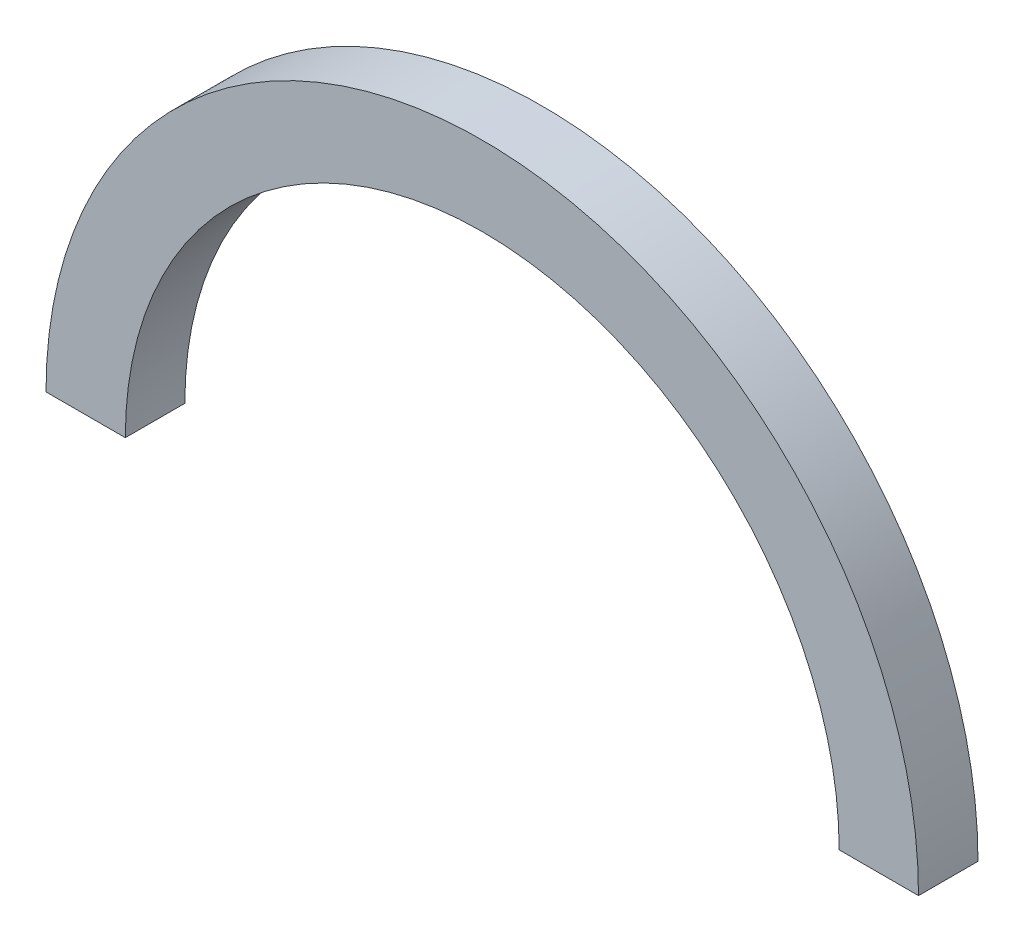
ISO-10303-21;
HEADER;
FILE_DESCRIPTION(('STEP AP214'),'2;1');
FILE_NAME('part.step','',(''),(''),'','','');
FILE_SCHEMA(('AUTOMOTIVE_DESIGN { 1 0 10303 214 1 1 1 1 }'));
ENDSEC;
DATA;
#1=APPLICATION_CONTEXT('core data for automotive mechanical design processes');
#2=APPLICATION_PROTOCOL_DEFINITION('international standard','automotive_design',2000,#1);
#3=PRODUCT_CONTEXT('',#1,'mechanical');
#4=PRODUCT('Part','Part','',(#3));
#5=PRODUCT_RELATED_PRODUCT_CATEGORY('part','',(#4));
#6=PRODUCT_DEFINITION_FORMATION('','',#4);
#7=PRODUCT_DEFINITION_CONTEXT('part definition',#1,'design');
#8=PRODUCT_DEFINITION('design','',#6,#7);
#9=PRODUCT_DEFINITION_SHAPE('','',#8);
#10=(LENGTH_UNIT() NAMED_UNIT(*) SI_UNIT(.MILLI.,.METRE.));
#11=(NAMED_UNIT(*) PLANE_ANGLE_UNIT() SI_UNIT($,.RADIAN.));
#12=(NAMED_UNIT(*) SI_UNIT($,.STERADIAN.) SOLID_ANGLE_UNIT());
#13=UNCERTAINTY_MEASURE_WITH_UNIT(LENGTH_MEASURE(1.E-05),#10,'distance_accuracy_value','');
#14=(GEOMETRIC_REPRESENTATION_CONTEXT(3) GLOBAL_UNCERTAINTY_ASSIGNED_CONTEXT((#13)) GLOBAL_UNIT_ASSIGNED_CONTEXT((#10,
#11,#12)) REPRESENTATION_CONTEXT('',''));
#15=CARTESIAN_POINT('',(0.,0.,0.));
#16=DIRECTION('',(0.,0.,1.));
#17=DIRECTION('',(1.,0.,0.));
#18=AXIS2_PLACEMENT_3D('',#15,#16,#17);
#19=CARTESIAN_POINT('',(0.,0.,0.));
#20=DIRECTION('',(0.,1.,0.));
#21=DIRECTION('',(0.,0.,1.));
#22=AXIS2_PLACEMENT_3D('',#19,#20,#21);
#23=PLANE('',#22);
#24=DIRECTION('',(0.,0.,-1.));
#25=VECTOR('',#24,1.);
#26=CARTESIAN_POINT('',(2595.77195150848,0.,-6775.62174536809));
#27=LINE('',#26,#25);
#28=CARTESIAN_POINT('',(2595.77195150848,0.,-6625.62174536809));
#29=VERTEX_POINT('',#28);
#30=CARTESIAN_POINT('',(2595.77195150848,0.,-6775.62174536809));
#31=VERTEX_POINT('',#30);
#32=EDGE_CURVE('E67',#29,#31,#27,.T.);
#33=ORIENTED_EDGE('',*,*,#32,.F.);
#34=DIRECTION('',(1.,0.,0.));
#35=VECTOR('',#34,1.);
#36=CARTESIAN_POINT('',(2395.77195150848,0.,-6625.62174536809));
#37=LINE('',#36,#35);
#38=CARTESIAN_POINT('',(2395.77195150848,0.,-6625.62174536809));
#39=VERTEX_POINT('',#38);
#40=EDGE_CURVE('E71',#39,#29,#37,.T.);
#41=ORIENTED_EDGE('',*,*,#40,.F.);
#42=DIRECTION('',(0.,0.,1.));
#43=VECTOR('',#42,1.);
#44=CARTESIAN_POINT('',(2395.77195150848,0.,-6775.62174536809));
#45=LINE('',#44,#43);
#46=CARTESIAN_POINT('',(2395.77195150848,0.,-6775.62174536809));
#47=VERTEX_POINT('',#46);
#48=EDGE_CURVE('E74',#47,#39,#45,.T.);
#49=ORIENTED_EDGE('',*,*,#48,.F.);
#50=DIRECTION('',(-1.,0.,0.));
#51=VECTOR('',#50,1.);
#52=CARTESIAN_POINT('',(2395.77195150848,0.,-6775.62174536809));
#53=LINE('',#52,#51);
#54=EDGE_CURVE('E62',#31,#47,#53,.T.);
#55=ORIENTED_EDGE('',*,*,#54,.F.);
#56=EDGE_LOOP('',(#33,#41,#49,#55));
#57=FACE_BOUND('',#56,.T.);
#58=ADVANCED_FACE('F32',(#57),#23,.F.);
#59=CARTESIAN_POINT('',(6991.54390301696,4.37633554764194E-13,0.));
#60=DIRECTION('',(0.,-1.,0.));
#61=DIRECTION('',(0.,0.,1.));
#62=AXIS2_PLACEMENT_3D('',#59,#60,#61);
#63=PLANE('',#62);
#64=DIRECTION('',(0.,0.,-1.));
#65=VECTOR('',#64,1.);
#66=CARTESIAN_POINT('',(4395.77195150848,1.1974317359106E-13,-6775.62174536809));
#67=LINE('',#66,#65);
#68=CARTESIAN_POINT('',(4395.77195150848,1.1974317359106E-13,-6625.62174536809));
#69=VERTEX_POINT('',#68);
#70=CARTESIAN_POINT('',(4395.77195150848,1.1974317359106E-13,-6775.62174536809));
#71=VERTEX_POINT('',#70);
#72=EDGE_CURVE('E45',#69,#71,#67,.T.);
#73=ORIENTED_EDGE('',*,*,#72,.T.);
#74=DIRECTION('',(1.,0.,0.));
#75=VECTOR('',#74,1.);
#76=CARTESIAN_POINT('',(4595.77195150848,1.44236109574007E-13,-6775.62174536809));
#77=LINE('',#76,#75);
#78=CARTESIAN_POINT('',(4595.77195150848,1.44236109574007E-13,-6775.62174536809));
#79=VERTEX_POINT('',#78);
#80=EDGE_CURVE('E11',#71,#79,#77,.T.);
#81=ORIENTED_EDGE('',*,*,#80,.T.);
#82=DIRECTION('',(0.,0.,1.));
#83=VECTOR('',#82,1.);
#84=CARTESIAN_POINT('',(4595.77195150848,1.44236109574007E-13,-6775.62174536809));
#85=LINE('',#84,#83);
#86=CARTESIAN_POINT('',(4595.77195150848,1.44236109574007E-13,-6625.62174536809));
#87=VERTEX_POINT('',#86);
#88=EDGE_CURVE('E88',#79,#87,#85,.T.);
#89=ORIENTED_EDGE('',*,*,#88,.T.);
#90=DIRECTION('',(-1.,0.,0.));
#91=VECTOR('',#90,1.);
#92=CARTESIAN_POINT('',(4595.77195150848,1.44236109574007E-13,-6625.62174536809));
#93=LINE('',#92,#91);
#94=EDGE_CURVE('E51',#87,#69,#93,.T.);
#95=ORIENTED_EDGE('',*,*,#94,.T.);
#96=EDGE_LOOP('',(#73,#81,#89,#95));
#97=FACE_BOUND('',#96,.T.);
#98=ADVANCED_FACE('F113',(#97),#63,.T.);
#99=CARTESIAN_POINT('',(3495.77195150848,0.,-6700.62174536809));
#100=DIRECTION('',(0.,0.,-1.));
#101=DIRECTION('',(-1.,0.,0.));
#102=AXIS2_PLACEMENT_3D('',#99,#100,#101);
#103=CYLINDRICAL_SURFACE('',#102,1100.);
#104=CARTESIAN_POINT('',(3495.77195150848,0.,-6625.62174536809));
#105=DIRECTION('',(0.,0.,-1.));
#106=DIRECTION('',(-1.,0.,0.));
#107=AXIS2_PLACEMENT_3D('',#104,#105,#106);
#108=CIRCLE('',#107,1100.);
#109=EDGE_CURVE('E90',#39,#87,#108,.T.);
#110=ORIENTED_EDGE('',*,*,#109,.T.);
#111=ORIENTED_EDGE('',*,*,#88,.F.);
#112=CARTESIAN_POINT('',(3495.77195150848,0.,-6775.62174536809));
#113=DIRECTION('',(0.,0.,-1.));
#114=DIRECTION('',(-1.,0.,0.));
#115=AXIS2_PLACEMENT_3D('',#112,#113,#114);
#116=CIRCLE('',#115,1100.);
#117=EDGE_CURVE('E84',#47,#79,#116,.T.);
#118=ORIENTED_EDGE('',*,*,#117,.F.);
#119=ORIENTED_EDGE('',*,*,#48,.T.);
#120=EDGE_LOOP('',(#110,#111,#118,#119));
#121=FACE_BOUND('',#120,.T.);
#122=ADVANCED_FACE('F87',(#121),#103,.T.);
#123=CARTESIAN_POINT('',(2395.77195150848,0.,-6625.62174536809));
#124=DIRECTION('',(0.,0.,1.));
#125=DIRECTION('',(1.,0.,0.));
#126=AXIS2_PLACEMENT_3D('',#123,#124,#125);
#127=PLANE('',#126);
#128=CARTESIAN_POINT('',(3495.77195150848,0.,-6625.62174536809));
#129=DIRECTION('',(0.,0.,-1.));
#130=DIRECTION('',(-1.,0.,0.));
#131=AXIS2_PLACEMENT_3D('',#128,#129,#130);
#132=CIRCLE('',#131,899.999999999999);
#133=EDGE_CURVE('E96',#29,#69,#132,.T.);
#134=ORIENTED_EDGE('',*,*,#133,.T.);
#135=ORIENTED_EDGE('',*,*,#94,.F.);
#136=ORIENTED_EDGE('',*,*,#109,.F.);
#137=ORIENTED_EDGE('',*,*,#40,.T.);
#138=EDGE_LOOP('',(#134,#135,#136,#137));
#139=FACE_BOUND('',#138,.T.);
#140=ADVANCED_FACE('F105',(#139),#127,.T.);
#141=CARTESIAN_POINT('',(3495.77195150848,0.,-6700.62174536809));
#142=DIRECTION('',(0.,0.,-1.));
#143=DIRECTION('',(-1.,0.,0.));
#144=AXIS2_PLACEMENT_3D('',#141,#142,#143);
#145=CYLINDRICAL_SURFACE('',#144,899.999999999999);
#146=CARTESIAN_POINT('',(3495.77195150848,0.,-6775.62174536809));
#147=DIRECTION('',(0.,0.,-1.));
#148=DIRECTION('',(-1.,0.,0.));
#149=AXIS2_PLACEMENT_3D('',#146,#147,#148);
#150=CIRCLE('',#149,899.999999999999);
#151=EDGE_CURVE('E39',#31,#71,#150,.T.);
#152=ORIENTED_EDGE('',*,*,#151,.T.);
#153=ORIENTED_EDGE('',*,*,#72,.F.);
#154=ORIENTED_EDGE('',*,*,#133,.F.);
#155=ORIENTED_EDGE('',*,*,#32,.T.);
#156=EDGE_LOOP('',(#152,#153,#154,#155));
#157=FACE_BOUND('',#156,.T.);
#158=ADVANCED_FACE('F102',(#157),#145,.F.);
#159=CARTESIAN_POINT('',(2395.77195150848,0.,-6775.62174536809));
#160=DIRECTION('',(0.,0.,-1.));
#161=DIRECTION('',(-1.,0.,0.));
#162=AXIS2_PLACEMENT_3D('',#159,#160,#161);
#163=PLANE('',#162);
#164=ORIENTED_EDGE('',*,*,#80,.F.);
#165=ORIENTED_EDGE('',*,*,#151,.F.);
#166=ORIENTED_EDGE('',*,*,#54,.T.);
#167=ORIENTED_EDGE('',*,*,#117,.T.);
#168=EDGE_LOOP('',(#164,#165,#166,#167));
#169=FACE_BOUND('',#168,.T.);
#170=ADVANCED_FACE('F83',(#169),#163,.T.);
#171=CLOSED_SHELL('',(#58,#98,#122,#140,#158,#170));
#172=MANIFOLD_SOLID_BREP('B2',#171);
#173=ADVANCED_BREP_SHAPE_REPRESENTATION('',(#18,#172),#14);
#174=SHAPE_DEFINITION_REPRESENTATION(#9,#173);
ENDSEC;
END-ISO-10303-21;
